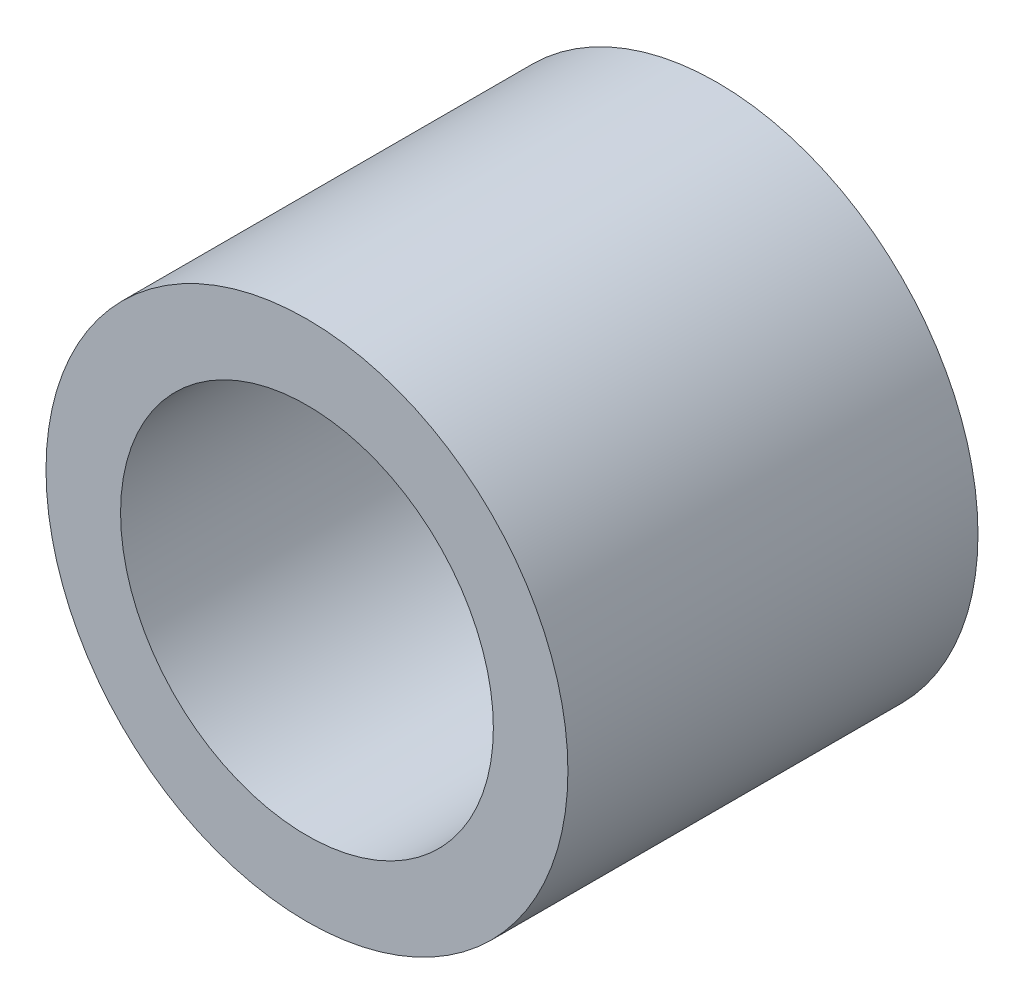
ISO-10303-21;
HEADER;
FILE_DESCRIPTION(('STEP AP214'),'2;1');
FILE_NAME('part.step','',(''),(''),'','','');
FILE_SCHEMA(('AUTOMOTIVE_DESIGN { 1 0 10303 214 1 1 1 1 }'));
ENDSEC;
DATA;
#1=APPLICATION_CONTEXT('core data for automotive mechanical design processes');
#2=APPLICATION_PROTOCOL_DEFINITION('international standard','automotive_design',2000,#1);
#3=PRODUCT_CONTEXT('',#1,'mechanical');
#4=PRODUCT('Part','Part','',(#3));
#5=PRODUCT_RELATED_PRODUCT_CATEGORY('part','',(#4));
#6=PRODUCT_DEFINITION_FORMATION('','',#4);
#7=PRODUCT_DEFINITION_CONTEXT('part definition',#1,'design');
#8=PRODUCT_DEFINITION('design','',#6,#7);
#9=PRODUCT_DEFINITION_SHAPE('','',#8);
#10=(LENGTH_UNIT() NAMED_UNIT(*) SI_UNIT(.MILLI.,.METRE.));
#11=(NAMED_UNIT(*) PLANE_ANGLE_UNIT() SI_UNIT($,.RADIAN.));
#12=(NAMED_UNIT(*) SI_UNIT($,.STERADIAN.) SOLID_ANGLE_UNIT());
#13=UNCERTAINTY_MEASURE_WITH_UNIT(LENGTH_MEASURE(1.E-05),#10,'distance_accuracy_value','');
#14=(GEOMETRIC_REPRESENTATION_CONTEXT(3) GLOBAL_UNCERTAINTY_ASSIGNED_CONTEXT((#13)) GLOBAL_UNIT_ASSIGNED_CONTEXT((#10,
#11,#12)) REPRESENTATION_CONTEXT('',''));
#15=CARTESIAN_POINT('',(0.,0.,0.));
#16=DIRECTION('',(0.,0.,1.));
#17=DIRECTION('',(1.,0.,0.));
#18=AXIS2_PLACEMENT_3D('',#15,#16,#17);
#19=CARTESIAN_POINT('',(0.,0.,11.));
#20=DIRECTION('',(0.,0.,1.));
#21=DIRECTION('',(1.,0.,0.));
#22=AXIS2_PLACEMENT_3D('',#19,#20,#21);
#23=PLANE('',#22);
#24=CARTESIAN_POINT('',(0.,0.,11.));
#25=DIRECTION('',(0.,0.,1.));
#26=DIRECTION('',(1.,0.,0.));
#27=AXIS2_PLACEMENT_3D('',#24,#25,#26);
#28=CIRCLE('',#27,7.);
#29=CARTESIAN_POINT('',(7.,0.,11.));
#30=VERTEX_POINT('',#29);
#31=EDGE_CURVE('E10',#30,#30,#28,.T.);
#32=ORIENTED_EDGE('',*,*,#31,.T.);
#33=EDGE_LOOP('',(#32));
#34=FACE_BOUND('',#33,.T.);
#35=CARTESIAN_POINT('',(0.,0.,11.));
#36=DIRECTION('',(0.,0.,1.));
#37=DIRECTION('',(1.,0.,0.));
#38=AXIS2_PLACEMENT_3D('',#35,#36,#37);
#39=CIRCLE('',#38,5.);
#40=CARTESIAN_POINT('',(5.,0.,11.));
#41=VERTEX_POINT('',#40);
#42=EDGE_CURVE('E48',#41,#41,#39,.T.);
#43=ORIENTED_EDGE('',*,*,#42,.F.);
#44=EDGE_LOOP('',(#43));
#45=FACE_BOUND('',#44,.T.);
#46=ADVANCED_FACE('F37',(#34,#45),#23,.T.);
#47=CARTESIAN_POINT('',(0.,0.,0.));
#48=DIRECTION('',(0.,0.,1.));
#49=DIRECTION('',(1.,0.,0.));
#50=AXIS2_PLACEMENT_3D('',#47,#48,#49);
#51=PLANE('',#50);
#52=CARTESIAN_POINT('',(0.,0.,0.));
#53=DIRECTION('',(0.,0.,1.));
#54=DIRECTION('',(1.,0.,0.));
#55=AXIS2_PLACEMENT_3D('',#52,#53,#54);
#56=CIRCLE('',#55,7.);
#57=CARTESIAN_POINT('',(7.,0.,0.));
#58=VERTEX_POINT('',#57);
#59=EDGE_CURVE('E41',#58,#58,#56,.T.);
#60=ORIENTED_EDGE('',*,*,#59,.F.);
#61=EDGE_LOOP('',(#60));
#62=FACE_BOUND('',#61,.T.);
#63=CARTESIAN_POINT('',(0.,0.,0.));
#64=DIRECTION('',(0.,0.,1.));
#65=DIRECTION('',(1.,0.,0.));
#66=AXIS2_PLACEMENT_3D('',#63,#64,#65);
#67=CIRCLE('',#66,5.);
#68=CARTESIAN_POINT('',(5.,0.,0.));
#69=VERTEX_POINT('',#68);
#70=EDGE_CURVE('E50',#69,#69,#67,.T.);
#71=ORIENTED_EDGE('',*,*,#70,.T.);
#72=EDGE_LOOP('',(#71));
#73=FACE_BOUND('',#72,.T.);
#74=ADVANCED_FACE('F60',(#62,#73),#51,.F.);
#75=CARTESIAN_POINT('',(0.,0.,11.));
#76=DIRECTION('',(0.,0.,-1.));
#77=DIRECTION('',(-1.,0.,0.));
#78=AXIS2_PLACEMENT_3D('',#75,#76,#77);
#79=CYLINDRICAL_SURFACE('',#78,7.);
#80=ORIENTED_EDGE('',*,*,#31,.F.);
#81=EDGE_LOOP('',(#80));
#82=FACE_BOUND('',#81,.T.);
#83=ORIENTED_EDGE('',*,*,#59,.T.);
#84=EDGE_LOOP('',(#83));
#85=FACE_BOUND('',#84,.T.);
#86=ADVANCED_FACE('F39',(#82,#85),#79,.T.);
#87=CARTESIAN_POINT('',(0.,0.,11.));
#88=DIRECTION('',(0.,0.,-1.));
#89=DIRECTION('',(-1.,0.,0.));
#90=AXIS2_PLACEMENT_3D('',#87,#88,#89);
#91=CYLINDRICAL_SURFACE('',#90,5.);
#92=ORIENTED_EDGE('',*,*,#42,.T.);
#93=EDGE_LOOP('',(#92));
#94=FACE_BOUND('',#93,.T.);
#95=ORIENTED_EDGE('',*,*,#70,.F.);
#96=EDGE_LOOP('',(#95));
#97=FACE_BOUND('',#96,.T.);
#98=ADVANCED_FACE('F56',(#94,#97),#91,.F.);
#99=CLOSED_SHELL('',(#46,#74,#86,#98));
#100=MANIFOLD_SOLID_BREP('B2',#99);
#101=ADVANCED_BREP_SHAPE_REPRESENTATION('',(#18,#100),#14);
#102=SHAPE_DEFINITION_REPRESENTATION(#9,#101);
ENDSEC;
END-ISO-10303-21;
